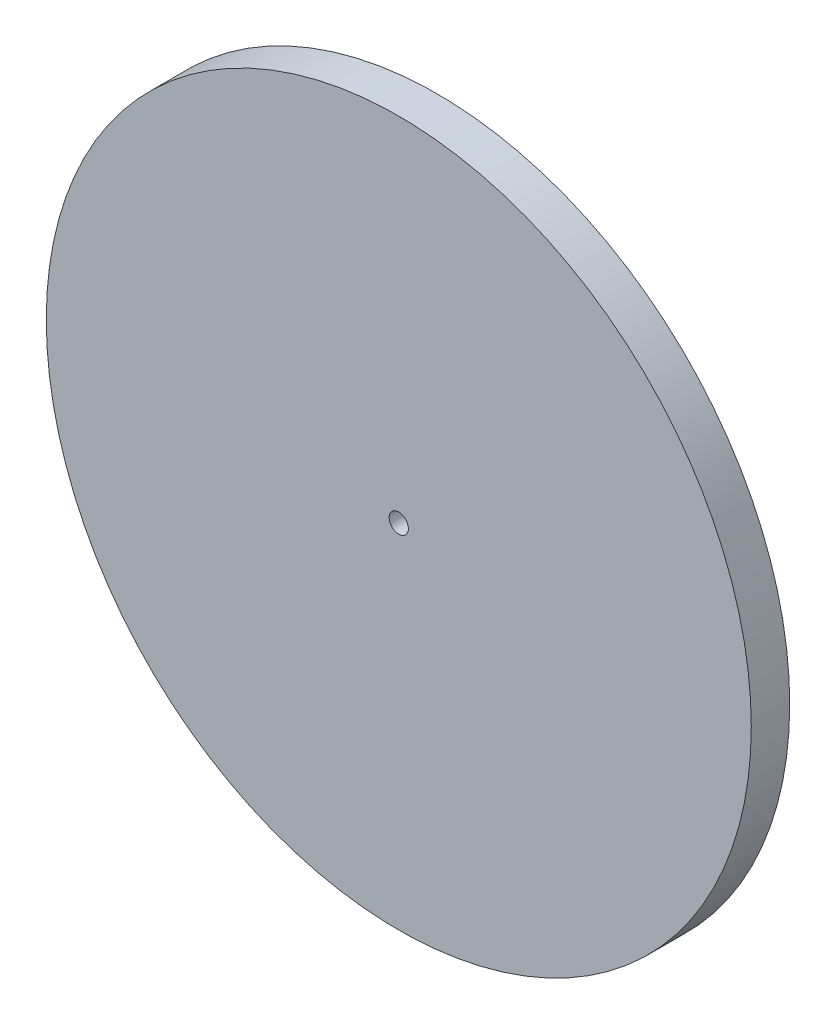
ISO-10303-21;
HEADER;
FILE_DESCRIPTION(('STEP AP214'),'2;1');
FILE_NAME('part.step','',(''),(''),'','','');
FILE_SCHEMA(('AUTOMOTIVE_DESIGN { 1 0 10303 214 1 1 1 1 }'));
ENDSEC;
DATA;
#1=APPLICATION_CONTEXT('core data for automotive mechanical design processes');
#2=APPLICATION_PROTOCOL_DEFINITION('international standard','automotive_design',2000,#1);
#3=PRODUCT_CONTEXT('',#1,'mechanical');
#4=PRODUCT('Part','Part','',(#3));
#5=PRODUCT_RELATED_PRODUCT_CATEGORY('part','',(#4));
#6=PRODUCT_DEFINITION_FORMATION('','',#4);
#7=PRODUCT_DEFINITION_CONTEXT('part definition',#1,'design');
#8=PRODUCT_DEFINITION('design','',#6,#7);
#9=PRODUCT_DEFINITION_SHAPE('','',#8);
#10=(LENGTH_UNIT() NAMED_UNIT(*) SI_UNIT(.MILLI.,.METRE.));
#11=(NAMED_UNIT(*) PLANE_ANGLE_UNIT() SI_UNIT($,.RADIAN.));
#12=(NAMED_UNIT(*) SI_UNIT($,.STERADIAN.) SOLID_ANGLE_UNIT());
#13=UNCERTAINTY_MEASURE_WITH_UNIT(LENGTH_MEASURE(1.E-05),#10,'distance_accuracy_value','');
#14=(GEOMETRIC_REPRESENTATION_CONTEXT(3) GLOBAL_UNCERTAINTY_ASSIGNED_CONTEXT((#13)) GLOBAL_UNIT_ASSIGNED_CONTEXT((#10,
#11,#12)) REPRESENTATION_CONTEXT('',''));
#15=CARTESIAN_POINT('',(0.,0.,0.));
#16=DIRECTION('',(0.,0.,1.));
#17=DIRECTION('',(1.,0.,0.));
#18=AXIS2_PLACEMENT_3D('',#15,#16,#17);
#19=CARTESIAN_POINT('',(0.,0.,3.));
#20=DIRECTION('',(0.,0.,1.));
#21=DIRECTION('',(1.,0.,0.));
#22=AXIS2_PLACEMENT_3D('',#19,#20,#21);
#23=PLANE('',#22);
#24=CARTESIAN_POINT('',(0.,0.,3.));
#25=DIRECTION('',(0.,0.,1.));
#26=DIRECTION('',(1.,0.,0.));
#27=AXIS2_PLACEMENT_3D('',#24,#25,#26);
#28=CIRCLE('',#27,27.5);
#29=CARTESIAN_POINT('',(27.5,0.,3.));
#30=VERTEX_POINT('',#29);
#31=EDGE_CURVE('E10',#30,#30,#28,.T.);
#32=ORIENTED_EDGE('',*,*,#31,.T.);
#33=EDGE_LOOP('',(#32));
#34=FACE_BOUND('',#33,.T.);
#35=CARTESIAN_POINT('',(0.,0.,3.));
#36=DIRECTION('',(0.,0.,1.));
#37=DIRECTION('',(1.,0.,0.));
#38=AXIS2_PLACEMENT_3D('',#35,#36,#37);
#39=CIRCLE('',#38,0.75);
#40=CARTESIAN_POINT('',(0.75,0.,3.));
#41=VERTEX_POINT('',#40);
#42=EDGE_CURVE('E45',#41,#41,#39,.T.);
#43=ORIENTED_EDGE('',*,*,#42,.F.);
#44=EDGE_LOOP('',(#43));
#45=FACE_BOUND('',#44,.T.);
#46=ADVANCED_FACE('F34',(#34,#45),#23,.T.);
#47=CARTESIAN_POINT('',(0.,0.,0.));
#48=DIRECTION('',(0.,0.,1.));
#49=DIRECTION('',(1.,0.,0.));
#50=AXIS2_PLACEMENT_3D('',#47,#48,#49);
#51=PLANE('',#50);
#52=CARTESIAN_POINT('',(0.,0.,0.));
#53=DIRECTION('',(0.,0.,1.));
#54=DIRECTION('',(1.,0.,0.));
#55=AXIS2_PLACEMENT_3D('',#52,#53,#54);
#56=CIRCLE('',#55,27.5);
#57=CARTESIAN_POINT('',(27.5,0.,0.));
#58=VERTEX_POINT('',#57);
#59=EDGE_CURVE('E38',#58,#58,#56,.T.);
#60=ORIENTED_EDGE('',*,*,#59,.F.);
#61=EDGE_LOOP('',(#60));
#62=FACE_BOUND('',#61,.T.);
#63=CARTESIAN_POINT('',(0.,0.,0.));
#64=DIRECTION('',(0.,0.,1.));
#65=DIRECTION('',(1.,0.,0.));
#66=AXIS2_PLACEMENT_3D('',#63,#64,#65);
#67=CIRCLE('',#66,0.75);
#68=CARTESIAN_POINT('',(0.75,0.,0.));
#69=VERTEX_POINT('',#68);
#70=EDGE_CURVE('E47',#69,#69,#67,.T.);
#71=ORIENTED_EDGE('',*,*,#70,.T.);
#72=EDGE_LOOP('',(#71));
#73=FACE_BOUND('',#72,.T.);
#74=ADVANCED_FACE('F57',(#62,#73),#51,.F.);
#75=CARTESIAN_POINT('',(0.,0.,3.));
#76=DIRECTION('',(0.,0.,-1.));
#77=DIRECTION('',(-1.,0.,0.));
#78=AXIS2_PLACEMENT_3D('',#75,#76,#77);
#79=CYLINDRICAL_SURFACE('',#78,27.5);
#80=ORIENTED_EDGE('',*,*,#31,.F.);
#81=EDGE_LOOP('',(#80));
#82=FACE_BOUND('',#81,.T.);
#83=ORIENTED_EDGE('',*,*,#59,.T.);
#84=EDGE_LOOP('',(#83));
#85=FACE_BOUND('',#84,.T.);
#86=ADVANCED_FACE('F36',(#82,#85),#79,.T.);
#87=CARTESIAN_POINT('',(0.,0.,3.));
#88=DIRECTION('',(0.,0.,-1.));
#89=DIRECTION('',(-1.,0.,0.));
#90=AXIS2_PLACEMENT_3D('',#87,#88,#89);
#91=CYLINDRICAL_SURFACE('',#90,0.75);
#92=ORIENTED_EDGE('',*,*,#42,.T.);
#93=EDGE_LOOP('',(#92));
#94=FACE_BOUND('',#93,.T.);
#95=ORIENTED_EDGE('',*,*,#70,.F.);
#96=EDGE_LOOP('',(#95));
#97=FACE_BOUND('',#96,.T.);
#98=ADVANCED_FACE('F53',(#94,#97),#91,.F.);
#99=CLOSED_SHELL('',(#46,#74,#86,#98));
#100=MANIFOLD_SOLID_BREP('B2',#99);
#101=ADVANCED_BREP_SHAPE_REPRESENTATION('',(#18,#100),#14);
#102=SHAPE_DEFINITION_REPRESENTATION(#9,#101);
ENDSEC;
END-ISO-10303-21;
